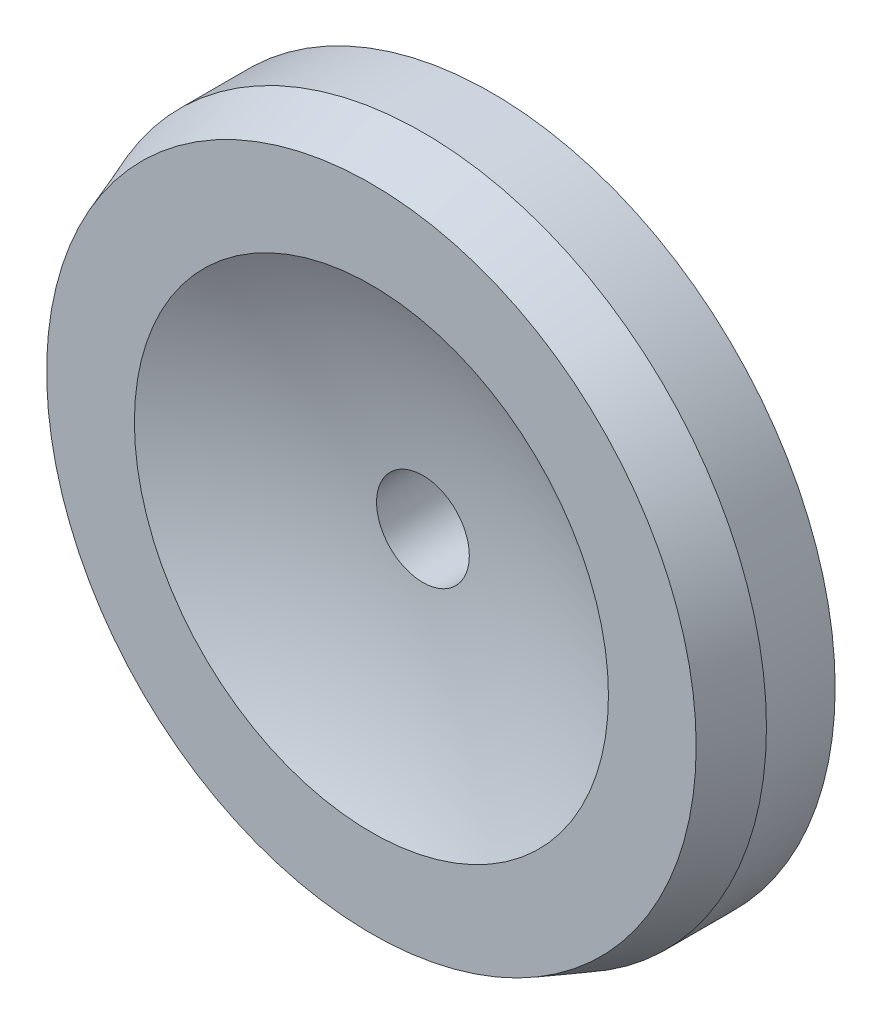
ISO-10303-21;
HEADER;
FILE_DESCRIPTION(('STEP AP214'),'2;1');
FILE_NAME('part.step','',(''),(''),'','','');
FILE_SCHEMA(('AUTOMOTIVE_DESIGN { 1 0 10303 214 1 1 1 1 }'));
ENDSEC;
DATA;
#1=APPLICATION_CONTEXT('core data for automotive mechanical design processes');
#2=APPLICATION_PROTOCOL_DEFINITION('international standard','automotive_design',2000,#1);
#3=PRODUCT_CONTEXT('',#1,'mechanical');
#4=PRODUCT('Part','Part','',(#3));
#5=PRODUCT_RELATED_PRODUCT_CATEGORY('part','',(#4));
#6=PRODUCT_DEFINITION_FORMATION('','',#4);
#7=PRODUCT_DEFINITION_CONTEXT('part definition',#1,'design');
#8=PRODUCT_DEFINITION('design','',#6,#7);
#9=PRODUCT_DEFINITION_SHAPE('','',#8);
#10=(LENGTH_UNIT() NAMED_UNIT(*) SI_UNIT(.MILLI.,.METRE.));
#11=(NAMED_UNIT(*) PLANE_ANGLE_UNIT() SI_UNIT($,.RADIAN.));
#12=(NAMED_UNIT(*) SI_UNIT($,.STERADIAN.) SOLID_ANGLE_UNIT());
#13=UNCERTAINTY_MEASURE_WITH_UNIT(LENGTH_MEASURE(1.E-05),#10,'distance_accuracy_value','');
#14=(GEOMETRIC_REPRESENTATION_CONTEXT(3) GLOBAL_UNCERTAINTY_ASSIGNED_CONTEXT((#13)) GLOBAL_UNIT_ASSIGNED_CONTEXT((#10,
#11,#12)) REPRESENTATION_CONTEXT('',''));
#15=CARTESIAN_POINT('',(0.,0.,0.));
#16=DIRECTION('',(0.,0.,1.));
#17=DIRECTION('',(1.,0.,0.));
#18=AXIS2_PLACEMENT_3D('',#15,#16,#17);
#19=CARTESIAN_POINT('',(0.,-10.25,1.69));
#20=DIRECTION('',(0.,0.,-1.));
#21=DIRECTION('',(-1.,0.,0.));
#22=AXIS2_PLACEMENT_3D('',#19,#20,#21);
#23=CONICAL_SURFACE('',#22,0.945404464860069,0.349065850398868);
#24=CARTESIAN_POINT('',(0.,-10.25,1.54));
#25=DIRECTION('',(0.,0.,1.));
#26=DIRECTION('',(1.,0.,0.));
#27=AXIS2_PLACEMENT_3D('',#24,#25,#26);
#28=CIRCLE('',#27,1.);
#29=CARTESIAN_POINT('',(0.999999999999999,-10.25,1.54));
#30=VERTEX_POINT('',#29);
#31=EDGE_CURVE('E52',#30,#30,#28,.T.);
#32=ORIENTED_EDGE('',*,*,#31,.T.);
#33=EDGE_LOOP('',(#32));
#34=FACE_BOUND('',#33,.T.);
#35=CARTESIAN_POINT('',(0.,-10.25,1.69));
#36=DIRECTION('',(0.,0.,1.));
#37=DIRECTION('',(1.,0.,0.));
#38=AXIS2_PLACEMENT_3D('',#35,#36,#37);
#39=CIRCLE('',#38,0.945404464860069);
#40=CARTESIAN_POINT('',(0.945404464860068,-10.25,1.69));
#41=VERTEX_POINT('',#40);
#42=EDGE_CURVE('E10',#41,#41,#39,.T.);
#43=ORIENTED_EDGE('',*,*,#42,.F.);
#44=EDGE_LOOP('',(#43));
#45=FACE_BOUND('',#44,.T.);
#46=ADVANCED_FACE('F30',(#34,#45),#23,.T.);
#47=CARTESIAN_POINT('',(0.69,-10.25,1.69));
#48=DIRECTION('',(0.,0.,1.));
#49=DIRECTION('',(1.,0.,0.));
#50=AXIS2_PLACEMENT_3D('',#47,#48,#49);
#51=PLANE('',#50);
#52=ORIENTED_EDGE('',*,*,#42,.T.);
#53=EDGE_LOOP('',(#52));
#54=FACE_BOUND('',#53,.T.);
#55=CARTESIAN_POINT('',(0.,-10.25,1.69));
#56=DIRECTION('',(0.,0.,1.));
#57=DIRECTION('',(1.,0.,0.));
#58=AXIS2_PLACEMENT_3D('',#55,#56,#57);
#59=CIRCLE('',#58,0.690000000000001);
#60=CARTESIAN_POINT('',(0.69,-10.25,1.69));
#61=VERTEX_POINT('',#60);
#62=EDGE_CURVE('E36',#61,#61,#59,.T.);
#63=ORIENTED_EDGE('',*,*,#62,.F.);
#64=EDGE_LOOP('',(#63));
#65=FACE_BOUND('',#64,.T.);
#66=ADVANCED_FACE('F70',(#54,#65),#51,.T.);
#67=CARTESIAN_POINT('',(0.,-10.25,3.14125));
#68=DIRECTION('',(0.,0.,1.));
#69=DIRECTION('',(1.,0.,0.));
#70=AXIS2_PLACEMENT_3D('',#67,#68,#69);
#71=SPHERICAL_SURFACE('',#70,1.60693078957994);
#72=ORIENTED_EDGE('',*,*,#62,.T.);
#73=EDGE_LOOP('',(#72));
#74=FACE_BOUND('',#73,.T.);
#75=CARTESIAN_POINT('',(0.,-10.25,1.54));
#76=DIRECTION('',(0.,0.,1.));
#77=DIRECTION('',(1.,0.,0.));
#78=AXIS2_PLACEMENT_3D('',#75,#76,#77);
#79=CIRCLE('',#78,0.135000000000001);
#80=CARTESIAN_POINT('',(0.135,-10.25,1.54));
#81=VERTEX_POINT('',#80);
#82=EDGE_CURVE('E40',#81,#81,#79,.T.);
#83=ORIENTED_EDGE('',*,*,#82,.F.);
#84=EDGE_LOOP('',(#83));
#85=FACE_BOUND('',#84,.T.);
#86=ADVANCED_FACE('F74',(#74,#85),#71,.F.);
#87=CARTESIAN_POINT('',(0.,-10.25,1.34));
#88=DIRECTION('',(0.,0.,1.));
#89=DIRECTION('',(1.,0.,0.));
#90=AXIS2_PLACEMENT_3D('',#87,#88,#89);
#91=CYLINDRICAL_SURFACE('',#90,0.135000000000001);
#92=ORIENTED_EDGE('',*,*,#82,.T.);
#93=EDGE_LOOP('',(#92));
#94=FACE_BOUND('',#93,.T.);
#95=CARTESIAN_POINT('',(0.,-10.25,1.34));
#96=DIRECTION('',(0.,0.,1.));
#97=DIRECTION('',(1.,0.,0.));
#98=AXIS2_PLACEMENT_3D('',#95,#96,#97);
#99=CIRCLE('',#98,0.135000000000001);
#100=CARTESIAN_POINT('',(0.135,-10.25,1.34));
#101=VERTEX_POINT('',#100);
#102=EDGE_CURVE('E44',#101,#101,#99,.T.);
#103=ORIENTED_EDGE('',*,*,#102,.F.);
#104=EDGE_LOOP('',(#103));
#105=FACE_BOUND('',#104,.T.);
#106=ADVANCED_FACE('F66',(#94,#105),#91,.F.);
#107=CARTESIAN_POINT('',(0.999999999999999,-10.25,1.34));
#108=DIRECTION('',(0.,0.,-1.));
#109=DIRECTION('',(-1.,0.,0.));
#110=AXIS2_PLACEMENT_3D('',#107,#108,#109);
#111=PLANE('',#110);
#112=ORIENTED_EDGE('',*,*,#102,.T.);
#113=EDGE_LOOP('',(#112));
#114=FACE_BOUND('',#113,.T.);
#115=CARTESIAN_POINT('',(0.,-10.25,1.34));
#116=DIRECTION('',(0.,0.,1.));
#117=DIRECTION('',(1.,0.,0.));
#118=AXIS2_PLACEMENT_3D('',#115,#116,#117);
#119=CIRCLE('',#118,1.);
#120=CARTESIAN_POINT('',(0.999999999999999,-10.25,1.34));
#121=VERTEX_POINT('',#120);
#122=EDGE_CURVE('E49',#121,#121,#119,.T.);
#123=ORIENTED_EDGE('',*,*,#122,.F.);
#124=EDGE_LOOP('',(#123));
#125=FACE_BOUND('',#124,.T.);
#126=ADVANCED_FACE('F60',(#114,#125),#111,.T.);
#127=CARTESIAN_POINT('',(0.,-10.25,1.34));
#128=DIRECTION('',(0.,0.,1.));
#129=DIRECTION('',(1.,0.,0.));
#130=AXIS2_PLACEMENT_3D('',#127,#128,#129);
#131=CYLINDRICAL_SURFACE('',#130,1.);
#132=ORIENTED_EDGE('',*,*,#122,.T.);
#133=EDGE_LOOP('',(#132));
#134=FACE_BOUND('',#133,.T.);
#135=ORIENTED_EDGE('',*,*,#31,.F.);
#136=EDGE_LOOP('',(#135));
#137=FACE_BOUND('',#136,.T.);
#138=ADVANCED_FACE('F58',(#134,#137),#131,.T.);
#139=CLOSED_SHELL('',(#46,#66,#86,#106,#126,#138));
#140=MANIFOLD_SOLID_BREP('B2',#139);
#141=ADVANCED_BREP_SHAPE_REPRESENTATION('',(#18,#140),#14);
#142=SHAPE_DEFINITION_REPRESENTATION(#9,#141);
ENDSEC;
END-ISO-10303-21;
